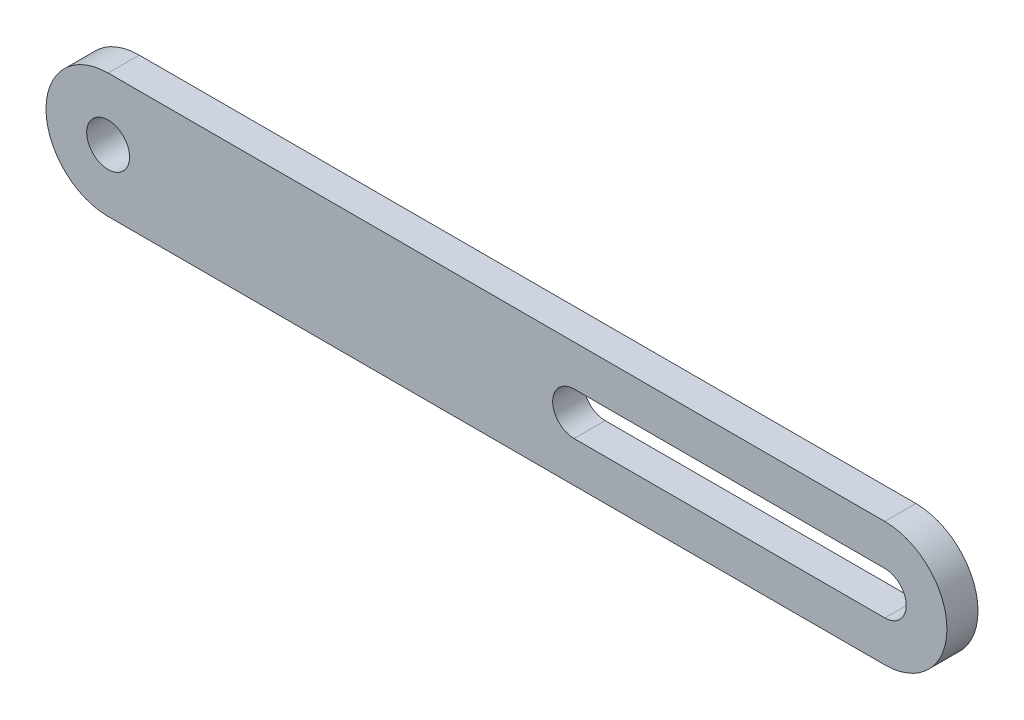
ISO-10303-21;
HEADER;
FILE_DESCRIPTION(('STEP AP214'),'2;1');
FILE_NAME('part.step','',(''),(''),'','','');
FILE_SCHEMA(('AUTOMOTIVE_DESIGN { 1 0 10303 214 1 1 1 1 }'));
ENDSEC;
DATA;
#1=APPLICATION_CONTEXT('core data for automotive mechanical design processes');
#2=APPLICATION_PROTOCOL_DEFINITION('international standard','automotive_design',2000,#1);
#3=PRODUCT_CONTEXT('',#1,'mechanical');
#4=PRODUCT('Part','Part','',(#3));
#5=PRODUCT_RELATED_PRODUCT_CATEGORY('part','',(#4));
#6=PRODUCT_DEFINITION_FORMATION('','',#4);
#7=PRODUCT_DEFINITION_CONTEXT('part definition',#1,'design');
#8=PRODUCT_DEFINITION('design','',#6,#7);
#9=PRODUCT_DEFINITION_SHAPE('','',#8);
#10=(LENGTH_UNIT() NAMED_UNIT(*) SI_UNIT(.MILLI.,.METRE.));
#11=(NAMED_UNIT(*) PLANE_ANGLE_UNIT() SI_UNIT($,.RADIAN.));
#12=(NAMED_UNIT(*) SI_UNIT($,.STERADIAN.) SOLID_ANGLE_UNIT());
#13=UNCERTAINTY_MEASURE_WITH_UNIT(LENGTH_MEASURE(1.E-05),#10,'distance_accuracy_value','');
#14=(GEOMETRIC_REPRESENTATION_CONTEXT(3) GLOBAL_UNCERTAINTY_ASSIGNED_CONTEXT((#13)) GLOBAL_UNIT_ASSIGNED_CONTEXT((#10,
#11,#12)) REPRESENTATION_CONTEXT('',''));
#15=CARTESIAN_POINT('',(0.,0.,0.));
#16=DIRECTION('',(0.,0.,1.));
#17=DIRECTION('',(1.,0.,0.));
#18=AXIS2_PLACEMENT_3D('',#15,#16,#17);
#19=CARTESIAN_POINT('',(63.5,0.,0.));
#20=DIRECTION('',(0.,0.,1.));
#21=DIRECTION('',(1.,0.,0.));
#22=AXIS2_PLACEMENT_3D('',#19,#20,#21);
#23=CYLINDRICAL_SURFACE('',#22,1.7526);
#24=CARTESIAN_POINT('',(63.5,0.,0.));
#25=DIRECTION('',(0.,0.,-1.));
#26=DIRECTION('',(-1.,0.,0.));
#27=AXIS2_PLACEMENT_3D('',#24,#25,#26);
#28=CIRCLE('',#27,1.7526);
#29=CARTESIAN_POINT('',(63.5,1.7526,0.));
#30=VERTEX_POINT('',#29);
#31=CARTESIAN_POINT('',(63.5,-1.7526,0.));
#32=VERTEX_POINT('',#31);
#33=EDGE_CURVE('E96',#30,#32,#28,.T.);
#34=ORIENTED_EDGE('',*,*,#33,.T.);
#35=DIRECTION('',(0.,0.,1.));
#36=VECTOR('',#35,1.);
#37=CARTESIAN_POINT('',(63.5,-1.7526,0.));
#38=LINE('',#37,#36);
#39=CARTESIAN_POINT('',(63.5,-1.7526,2.54));
#40=VERTEX_POINT('',#39);
#41=EDGE_CURVE('E83',#32,#40,#38,.T.);
#42=ORIENTED_EDGE('',*,*,#41,.T.);
#43=CARTESIAN_POINT('',(63.5,0.,2.54));
#44=DIRECTION('',(0.,0.,1.));
#45=DIRECTION('',(1.,0.,0.));
#46=AXIS2_PLACEMENT_3D('',#43,#44,#45);
#47=CIRCLE('',#46,1.7526);
#48=CARTESIAN_POINT('',(63.5,1.7526,2.54));
#49=VERTEX_POINT('',#48);
#50=EDGE_CURVE('E37',#49,#40,#47,.F.);
#51=ORIENTED_EDGE('',*,*,#50,.F.);
#52=DIRECTION('',(0.,0.,1.));
#53=VECTOR('',#52,1.);
#54=CARTESIAN_POINT('',(63.5,1.7526,0.));
#55=LINE('',#54,#53);
#56=EDGE_CURVE('E70',#30,#49,#55,.T.);
#57=ORIENTED_EDGE('',*,*,#56,.F.);
#58=EDGE_LOOP('',(#34,#42,#51,#57));
#59=FACE_BOUND('',#58,.T.);
#60=ADVANCED_FACE('F33',(#59),#23,.F.);
#61=CARTESIAN_POINT('',(0.,0.,2.54));
#62=DIRECTION('',(0.,0.,-1.));
#63=DIRECTION('',(-1.,0.,0.));
#64=AXIS2_PLACEMENT_3D('',#61,#62,#63);
#65=CYLINDRICAL_SURFACE('',#64,5.08);
#66=CARTESIAN_POINT('',(0.,0.,0.));
#67=DIRECTION('',(0.,0.,1.));
#68=DIRECTION('',(1.,0.,0.));
#69=AXIS2_PLACEMENT_3D('',#66,#67,#68);
#70=CIRCLE('',#69,5.08);
#71=CARTESIAN_POINT('',(0.,5.08,0.));
#72=VERTEX_POINT('',#71);
#73=CARTESIAN_POINT('',(0.,-5.08,0.));
#74=VERTEX_POINT('',#73);
#75=EDGE_CURVE('E110',#72,#74,#70,.T.);
#76=ORIENTED_EDGE('',*,*,#75,.T.);
#77=DIRECTION('',(0.,0.,-1.));
#78=VECTOR('',#77,1.);
#79=CARTESIAN_POINT('',(0.,-5.08,2.54));
#80=LINE('',#79,#78);
#81=CARTESIAN_POINT('',(0.,-5.08,2.54));
#82=VERTEX_POINT('',#81);
#83=EDGE_CURVE('E11',#82,#74,#80,.T.);
#84=ORIENTED_EDGE('',*,*,#83,.F.);
#85=CARTESIAN_POINT('',(0.,0.,2.54));
#86=DIRECTION('',(0.,0.,1.));
#87=DIRECTION('',(1.,0.,0.));
#88=AXIS2_PLACEMENT_3D('',#85,#86,#87);
#89=CIRCLE('',#88,5.08);
#90=CARTESIAN_POINT('',(0.,5.08,2.54));
#91=VERTEX_POINT('',#90);
#92=EDGE_CURVE('E111',#91,#82,#89,.T.);
#93=ORIENTED_EDGE('',*,*,#92,.F.);
#94=DIRECTION('',(0.,0.,-1.));
#95=VECTOR('',#94,1.);
#96=CARTESIAN_POINT('',(0.,5.08,2.54));
#97=LINE('',#96,#95);
#98=EDGE_CURVE('E123',#91,#72,#97,.T.);
#99=ORIENTED_EDGE('',*,*,#98,.T.);
#100=EDGE_LOOP('',(#76,#84,#93,#99));
#101=FACE_BOUND('',#100,.T.);
#102=ADVANCED_FACE('F35',(#101),#65,.T.);
#103=CARTESIAN_POINT('',(0.,-5.08,2.54));
#104=DIRECTION('',(0.,1.,0.));
#105=DIRECTION('',(0.,0.,1.));
#106=AXIS2_PLACEMENT_3D('',#103,#104,#105);
#107=PLANE('',#106);
#108=DIRECTION('',(1.,0.,0.));
#109=VECTOR('',#108,1.);
#110=CARTESIAN_POINT('',(0.,-5.08,0.));
#111=LINE('',#110,#109);
#112=CARTESIAN_POINT('',(63.5,-5.08,0.));
#113=VERTEX_POINT('',#112);
#114=EDGE_CURVE('E126',#74,#113,#111,.T.);
#115=ORIENTED_EDGE('',*,*,#114,.T.);
#116=DIRECTION('',(0.,0.,-1.));
#117=VECTOR('',#116,1.);
#118=CARTESIAN_POINT('',(63.5,-5.08,2.54));
#119=LINE('',#118,#117);
#120=CARTESIAN_POINT('',(63.5,-5.08,2.54));
#121=VERTEX_POINT('',#120);
#122=EDGE_CURVE('E43',#121,#113,#119,.T.);
#123=ORIENTED_EDGE('',*,*,#122,.F.);
#124=DIRECTION('',(1.,0.,0.));
#125=VECTOR('',#124,1.);
#126=CARTESIAN_POINT('',(0.,-5.08,2.54));
#127=LINE('',#126,#125);
#128=EDGE_CURVE('E114',#82,#121,#127,.T.);
#129=ORIENTED_EDGE('',*,*,#128,.F.);
#130=ORIENTED_EDGE('',*,*,#83,.T.);
#131=EDGE_LOOP('',(#115,#123,#129,#130));
#132=FACE_BOUND('',#131,.T.);
#133=ADVANCED_FACE('F186',(#132),#107,.F.);
#134=CARTESIAN_POINT('',(63.5,0.,2.54));
#135=DIRECTION('',(0.,0.,-1.));
#136=DIRECTION('',(-1.,0.,0.));
#137=AXIS2_PLACEMENT_3D('',#134,#135,#136);
#138=CYLINDRICAL_SURFACE('',#137,5.08);
#139=CARTESIAN_POINT('',(63.5,0.,0.));
#140=DIRECTION('',(0.,0.,1.));
#141=DIRECTION('',(1.,0.,0.));
#142=AXIS2_PLACEMENT_3D('',#139,#140,#141);
#143=CIRCLE('',#142,5.08);
#144=CARTESIAN_POINT('',(63.5,5.08,0.));
#145=VERTEX_POINT('',#144);
#146=EDGE_CURVE('E129',#113,#145,#143,.T.);
#147=ORIENTED_EDGE('',*,*,#146,.T.);
#148=DIRECTION('',(0.,0.,-1.));
#149=VECTOR('',#148,1.);
#150=CARTESIAN_POINT('',(63.5,5.08,2.54));
#151=LINE('',#150,#149);
#152=CARTESIAN_POINT('',(63.5,5.08,2.54));
#153=VERTEX_POINT('',#152);
#154=EDGE_CURVE('E136',#153,#145,#151,.T.);
#155=ORIENTED_EDGE('',*,*,#154,.F.);
#156=CARTESIAN_POINT('',(63.5,0.,2.54));
#157=DIRECTION('',(0.,0.,1.));
#158=DIRECTION('',(1.,0.,0.));
#159=AXIS2_PLACEMENT_3D('',#156,#157,#158);
#160=CIRCLE('',#159,5.08);
#161=EDGE_CURVE('E118',#121,#153,#160,.T.);
#162=ORIENTED_EDGE('',*,*,#161,.F.);
#163=ORIENTED_EDGE('',*,*,#122,.T.);
#164=EDGE_LOOP('',(#147,#155,#162,#163));
#165=FACE_BOUND('',#164,.T.);
#166=ADVANCED_FACE('F189',(#165),#138,.T.);
#167=CARTESIAN_POINT('',(0.,5.08,2.54));
#168=DIRECTION('',(0.,-1.,0.));
#169=DIRECTION('',(0.,0.,-1.));
#170=AXIS2_PLACEMENT_3D('',#167,#168,#169);
#171=PLANE('',#170);
#172=DIRECTION('',(-1.,0.,0.));
#173=VECTOR('',#172,1.);
#174=CARTESIAN_POINT('',(0.,5.08,0.));
#175=LINE('',#174,#173);
#176=EDGE_CURVE('E115',#145,#72,#175,.T.);
#177=ORIENTED_EDGE('',*,*,#176,.T.);
#178=ORIENTED_EDGE('',*,*,#98,.F.);
#179=DIRECTION('',(-1.,0.,0.));
#180=VECTOR('',#179,1.);
#181=CARTESIAN_POINT('',(0.,5.08,2.54));
#182=LINE('',#181,#180);
#183=EDGE_CURVE('E121',#153,#91,#182,.T.);
#184=ORIENTED_EDGE('',*,*,#183,.F.);
#185=ORIENTED_EDGE('',*,*,#154,.T.);
#186=EDGE_LOOP('',(#177,#178,#184,#185));
#187=FACE_BOUND('',#186,.T.);
#188=ADVANCED_FACE('F177',(#187),#171,.F.);
#189=CARTESIAN_POINT('',(0.,0.,2.54));
#190=DIRECTION('',(0.,0.,1.));
#191=DIRECTION('',(1.,0.,0.));
#192=AXIS2_PLACEMENT_3D('',#189,#190,#191);
#193=PLANE('',#192);
#194=DIRECTION('',(1.,0.,0.));
#195=VECTOR('',#194,1.);
#196=CARTESIAN_POINT('',(63.5,-1.7526,2.54));
#197=LINE('',#196,#195);
#198=CARTESIAN_POINT('',(38.098730060259,-1.7526,2.54));
#199=VERTEX_POINT('',#198);
#200=EDGE_CURVE('E79',#199,#40,#197,.T.);
#201=ORIENTED_EDGE('',*,*,#200,.F.);
#202=CARTESIAN_POINT('',(38.098730060259,0.,2.54));
#203=DIRECTION('',(0.,0.,1.));
#204=DIRECTION('',(1.,0.,0.));
#205=AXIS2_PLACEMENT_3D('',#202,#203,#204);
#206=CIRCLE('',#205,1.7526);
#207=CARTESIAN_POINT('',(38.098730060259,1.7526,2.54));
#208=VERTEX_POINT('',#207);
#209=EDGE_CURVE('E90',#208,#199,#206,.T.);
#210=ORIENTED_EDGE('',*,*,#209,.F.);
#211=DIRECTION('',(-1.,0.,0.));
#212=VECTOR('',#211,1.);
#213=CARTESIAN_POINT('',(63.5,1.7526,2.54));
#214=LINE('',#213,#212);
#215=EDGE_CURVE('E91',#49,#208,#214,.T.);
#216=ORIENTED_EDGE('',*,*,#215,.F.);
#217=ORIENTED_EDGE('',*,*,#50,.T.);
#218=EDGE_LOOP('',(#201,#210,#216,#217));
#219=FACE_BOUND('',#218,.T.);
#220=CARTESIAN_POINT('',(0.,0.,2.54));
#221=DIRECTION('',(0.,0.,1.));
#222=DIRECTION('',(1.,0.,0.));
#223=AXIS2_PLACEMENT_3D('',#220,#221,#222);
#224=CIRCLE('',#223,1.7526);
#225=CARTESIAN_POINT('',(1.7526,0.,2.54));
#226=VERTEX_POINT('',#225);
#227=EDGE_CURVE('E102',#226,#226,#224,.T.);
#228=ORIENTED_EDGE('',*,*,#227,.F.);
#229=EDGE_LOOP('',(#228));
#230=FACE_BOUND('',#229,.T.);
#231=ORIENTED_EDGE('',*,*,#92,.T.);
#232=ORIENTED_EDGE('',*,*,#128,.T.);
#233=ORIENTED_EDGE('',*,*,#161,.T.);
#234=ORIENTED_EDGE('',*,*,#183,.T.);
#235=EDGE_LOOP('',(#231,#232,#233,#234));
#236=FACE_BOUND('',#235,.T.);
#237=ADVANCED_FACE('F98',(#219,#230,#236),#193,.T.);
#238=CARTESIAN_POINT('',(0.,0.,0.));
#239=DIRECTION('',(0.,0.,1.));
#240=DIRECTION('',(1.,0.,0.));
#241=AXIS2_PLACEMENT_3D('',#238,#239,#240);
#242=PLANE('',#241);
#243=CARTESIAN_POINT('',(38.098730060259,0.,0.));
#244=DIRECTION('',(0.,0.,1.));
#245=DIRECTION('',(1.,0.,0.));
#246=AXIS2_PLACEMENT_3D('',#243,#244,#245);
#247=CIRCLE('',#246,1.7526);
#248=CARTESIAN_POINT('',(38.098730060259,1.7526,0.));
#249=VERTEX_POINT('',#248);
#250=CARTESIAN_POINT('',(38.098730060259,-1.7526,0.));
#251=VERTEX_POINT('',#250);
#252=EDGE_CURVE('E148',#249,#251,#247,.T.);
#253=ORIENTED_EDGE('',*,*,#252,.T.);
#254=DIRECTION('',(1.,0.,0.));
#255=VECTOR('',#254,1.);
#256=CARTESIAN_POINT('',(63.5,-1.7526,0.));
#257=LINE('',#256,#255);
#258=EDGE_CURVE('E151',#251,#32,#257,.T.);
#259=ORIENTED_EDGE('',*,*,#258,.T.);
#260=ORIENTED_EDGE('',*,*,#33,.F.);
#261=DIRECTION('',(-1.,0.,0.));
#262=VECTOR('',#261,1.);
#263=CARTESIAN_POINT('',(63.5,1.7526,0.));
#264=LINE('',#263,#262);
#265=EDGE_CURVE('E52',#30,#249,#264,.T.);
#266=ORIENTED_EDGE('',*,*,#265,.T.);
#267=EDGE_LOOP('',(#253,#259,#260,#266));
#268=FACE_BOUND('',#267,.T.);
#269=CARTESIAN_POINT('',(0.,0.,0.));
#270=DIRECTION('',(0.,0.,1.));
#271=DIRECTION('',(1.,0.,0.));
#272=AXIS2_PLACEMENT_3D('',#269,#270,#271);
#273=CIRCLE('',#272,1.7526);
#274=CARTESIAN_POINT('',(1.7526,0.,0.));
#275=VERTEX_POINT('',#274);
#276=EDGE_CURVE('E100',#275,#275,#273,.T.);
#277=ORIENTED_EDGE('',*,*,#276,.T.);
#278=EDGE_LOOP('',(#277));
#279=FACE_BOUND('',#278,.T.);
#280=ORIENTED_EDGE('',*,*,#75,.F.);
#281=ORIENTED_EDGE('',*,*,#176,.F.);
#282=ORIENTED_EDGE('',*,*,#146,.F.);
#283=ORIENTED_EDGE('',*,*,#114,.F.);
#284=EDGE_LOOP('',(#280,#281,#282,#283));
#285=FACE_BOUND('',#284,.T.);
#286=ADVANCED_FACE('F156',(#268,#279,#285),#242,.F.);
#287=CARTESIAN_POINT('',(0.,0.,0.));
#288=DIRECTION('',(0.,0.,1.));
#289=DIRECTION('',(1.,0.,0.));
#290=AXIS2_PLACEMENT_3D('',#287,#288,#289);
#291=CYLINDRICAL_SURFACE('',#290,1.7526);
#292=ORIENTED_EDGE('',*,*,#227,.T.);
#293=EDGE_LOOP('',(#292));
#294=FACE_BOUND('',#293,.T.);
#295=ORIENTED_EDGE('',*,*,#276,.F.);
#296=EDGE_LOOP('',(#295));
#297=FACE_BOUND('',#296,.T.);
#298=ADVANCED_FACE('F205',(#294,#297),#291,.F.);
#299=CARTESIAN_POINT('',(63.5,-1.7526,0.));
#300=DIRECTION('',(0.,-1.,0.));
#301=DIRECTION('',(1.,0.,0.));
#302=AXIS2_PLACEMENT_3D('',#299,#300,#301);
#303=PLANE('',#302);
#304=ORIENTED_EDGE('',*,*,#200,.T.);
#305=ORIENTED_EDGE('',*,*,#41,.F.);
#306=ORIENTED_EDGE('',*,*,#258,.F.);
#307=DIRECTION('',(0.,0.,1.));
#308=VECTOR('',#307,1.);
#309=CARTESIAN_POINT('',(38.098730060259,-1.7526,0.));
#310=LINE('',#309,#308);
#311=EDGE_CURVE('E86',#251,#199,#310,.T.);
#312=ORIENTED_EDGE('',*,*,#311,.T.);
#313=EDGE_LOOP('',(#304,#305,#306,#312));
#314=FACE_BOUND('',#313,.T.);
#315=ADVANCED_FACE('F81',(#314),#303,.F.);
#316=CARTESIAN_POINT('',(38.098730060259,0.,0.));
#317=DIRECTION('',(0.,0.,1.));
#318=DIRECTION('',(1.,0.,0.));
#319=AXIS2_PLACEMENT_3D('',#316,#317,#318);
#320=CYLINDRICAL_SURFACE('',#319,1.7526);
#321=ORIENTED_EDGE('',*,*,#209,.T.);
#322=ORIENTED_EDGE('',*,*,#311,.F.);
#323=ORIENTED_EDGE('',*,*,#252,.F.);
#324=DIRECTION('',(0.,0.,1.));
#325=VECTOR('',#324,1.);
#326=CARTESIAN_POINT('',(38.098730060259,1.7526,0.));
#327=LINE('',#326,#325);
#328=EDGE_CURVE('E143',#249,#208,#327,.T.);
#329=ORIENTED_EDGE('',*,*,#328,.T.);
#330=EDGE_LOOP('',(#321,#322,#323,#329));
#331=FACE_BOUND('',#330,.T.);
#332=ADVANCED_FACE('F146',(#331),#320,.F.);
#333=CARTESIAN_POINT('',(63.5,1.7526,0.));
#334=DIRECTION('',(0.,1.,0.));
#335=DIRECTION('',(-1.,0.,0.));
#336=AXIS2_PLACEMENT_3D('',#333,#334,#335);
#337=PLANE('',#336);
#338=ORIENTED_EDGE('',*,*,#215,.T.);
#339=ORIENTED_EDGE('',*,*,#328,.F.);
#340=ORIENTED_EDGE('',*,*,#265,.F.);
#341=ORIENTED_EDGE('',*,*,#56,.T.);
#342=EDGE_LOOP('',(#338,#339,#340,#341));
#343=FACE_BOUND('',#342,.T.);
#344=ADVANCED_FACE('F142',(#343),#337,.F.);
#345=CLOSED_SHELL('',(#60,#102,#133,#166,#188,#237,#286,#298,#315,#332,#344));
#346=MANIFOLD_SOLID_BREP('B2',#345);
#347=ADVANCED_BREP_SHAPE_REPRESENTATION('',(#18,#346),#14);
#348=SHAPE_DEFINITION_REPRESENTATION(#9,#347);
ENDSEC;
END-ISO-10303-21;
